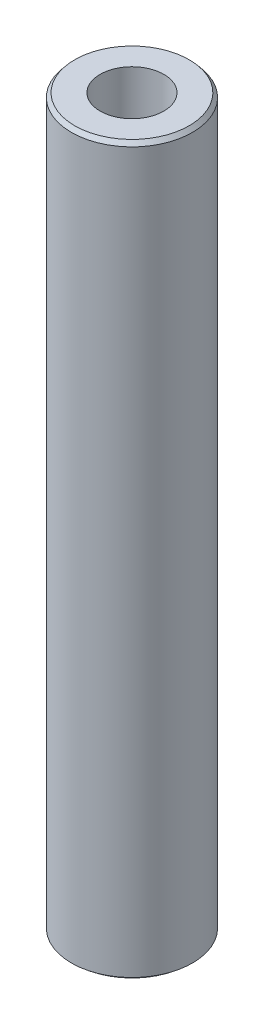
ISO-10303-21;
HEADER;
FILE_DESCRIPTION(('STEP AP214'),'2;1');
FILE_NAME('part.step','',(''),(''),'','','');
FILE_SCHEMA(('AUTOMOTIVE_DESIGN { 1 0 10303 214 1 1 1 1 }'));
ENDSEC;
DATA;
#1=APPLICATION_CONTEXT('core data for automotive mechanical design processes');
#2=APPLICATION_PROTOCOL_DEFINITION('international standard','automotive_design',2000,#1);
#3=PRODUCT_CONTEXT('',#1,'mechanical');
#4=PRODUCT('Part','Part','',(#3));
#5=PRODUCT_RELATED_PRODUCT_CATEGORY('part','',(#4));
#6=PRODUCT_DEFINITION_FORMATION('','',#4);
#7=PRODUCT_DEFINITION_CONTEXT('part definition',#1,'design');
#8=PRODUCT_DEFINITION('design','',#6,#7);
#9=PRODUCT_DEFINITION_SHAPE('','',#8);
#10=(LENGTH_UNIT() NAMED_UNIT(*) SI_UNIT(.MILLI.,.METRE.));
#11=(NAMED_UNIT(*) PLANE_ANGLE_UNIT() SI_UNIT($,.RADIAN.));
#12=(NAMED_UNIT(*) SI_UNIT($,.STERADIAN.) SOLID_ANGLE_UNIT());
#13=UNCERTAINTY_MEASURE_WITH_UNIT(LENGTH_MEASURE(1.E-05),#10,'distance_accuracy_value','');
#14=(GEOMETRIC_REPRESENTATION_CONTEXT(3) GLOBAL_UNCERTAINTY_ASSIGNED_CONTEXT((#13)) GLOBAL_UNIT_ASSIGNED_CONTEXT((#10,
#11,#12)) REPRESENTATION_CONTEXT('',''));
#15=CARTESIAN_POINT('',(0.,0.,0.));
#16=DIRECTION('',(0.,0.,1.));
#17=DIRECTION('',(1.,0.,0.));
#18=AXIS2_PLACEMENT_3D('',#15,#16,#17);
#19=CARTESIAN_POINT('',(0.,600.,0.));
#20=DIRECTION('',(0.,-1.,0.));
#21=DIRECTION('',(0.,0.,-1.));
#22=AXIS2_PLACEMENT_3D('',#19,#20,#21);
#23=CYLINDRICAL_SURFACE('',#22,50.);
#24=CARTESIAN_POINT('',(0.,596.621895699782,0.));
#25=DIRECTION('',(0.,1.,0.));
#26=DIRECTION('',(0.,0.,1.));
#27=AXIS2_PLACEMENT_3D('',#24,#25,#26);
#28=CIRCLE('',#27,50.);
#29=CARTESIAN_POINT('',(0.,596.621895699782,50.));
#30=VERTEX_POINT('',#29);
#31=EDGE_CURVE('E50',#30,#30,#28,.F.);
#32=ORIENTED_EDGE('',*,*,#31,.T.);
#33=EDGE_LOOP('',(#32));
#34=FACE_BOUND('',#33,.T.);
#35=CARTESIAN_POINT('',(0.,2.75421378136709,0.));
#36=DIRECTION('',(0.,1.,0.));
#37=DIRECTION('',(0.,0.,1.));
#38=AXIS2_PLACEMENT_3D('',#35,#36,#37);
#39=CIRCLE('',#38,50.);
#40=CARTESIAN_POINT('',(0.,2.75421378136709,50.));
#41=VERTEX_POINT('',#40);
#42=EDGE_CURVE('E51',#41,#41,#39,.T.);
#43=ORIENTED_EDGE('',*,*,#42,.T.);
#44=EDGE_LOOP('',(#43));
#45=FACE_BOUND('',#44,.T.);
#46=ADVANCED_FACE('F39',(#34,#45),#23,.T.);
#47=CARTESIAN_POINT('',(0.,600.,0.));
#48=DIRECTION('',(0.,1.,0.));
#49=DIRECTION('',(0.,0.,1.));
#50=AXIS2_PLACEMENT_3D('',#47,#48,#49);
#51=PLANE('',#50);
#52=CARTESIAN_POINT('',(0.,600.,0.));
#53=DIRECTION('',(0.,1.,0.));
#54=DIRECTION('',(0.,0.,1.));
#55=AXIS2_PLACEMENT_3D('',#52,#53,#54);
#56=CIRCLE('',#55,47.2457862186328);
#57=CARTESIAN_POINT('',(0.,600.,47.2457862186328));
#58=VERTEX_POINT('',#57);
#59=EDGE_CURVE('E54',#58,#58,#56,.T.);
#60=ORIENTED_EDGE('',*,*,#59,.T.);
#61=EDGE_LOOP('',(#60));
#62=FACE_BOUND('',#61,.T.);
#63=CARTESIAN_POINT('',(0.,600.,0.));
#64=DIRECTION('',(0.,1.,0.));
#65=DIRECTION('',(0.,0.,1.));
#66=AXIS2_PLACEMENT_3D('',#63,#64,#65);
#67=CIRCLE('',#66,26.3071268832011);
#68=CARTESIAN_POINT('',(0.,600.,26.3071268832011));
#69=VERTEX_POINT('',#68);
#70=EDGE_CURVE('E58',#69,#69,#67,.T.);
#71=ORIENTED_EDGE('',*,*,#70,.F.);
#72=EDGE_LOOP('',(#71));
#73=FACE_BOUND('',#72,.T.);
#74=ADVANCED_FACE('F69',(#62,#73),#51,.T.);
#75=CARTESIAN_POINT('',(0.,0.,0.));
#76=DIRECTION('',(0.,1.,0.));
#77=DIRECTION('',(0.,0.,1.));
#78=AXIS2_PLACEMENT_3D('',#75,#76,#77);
#79=PLANE('',#78);
#80=CARTESIAN_POINT('',(0.,0.,0.));
#81=DIRECTION('',(0.,1.,0.));
#82=DIRECTION('',(0.,0.,1.));
#83=AXIS2_PLACEMENT_3D('',#80,#81,#82);
#84=CIRCLE('',#83,46.6218956997819);
#85=CARTESIAN_POINT('',(0.,0.,46.6218956997819));
#86=VERTEX_POINT('',#85);
#87=EDGE_CURVE('E10',#86,#86,#84,.F.);
#88=ORIENTED_EDGE('',*,*,#87,.T.);
#89=EDGE_LOOP('',(#88));
#90=FACE_BOUND('',#89,.T.);
#91=CARTESIAN_POINT('',(0.,0.,0.));
#92=DIRECTION('',(0.,1.,0.));
#93=DIRECTION('',(0.,0.,1.));
#94=AXIS2_PLACEMENT_3D('',#91,#92,#93);
#95=CIRCLE('',#94,26.3071268832011);
#96=CARTESIAN_POINT('',(0.,0.,26.3071268832011));
#97=VERTEX_POINT('',#96);
#98=EDGE_CURVE('E63',#97,#97,#95,.T.);
#99=ORIENTED_EDGE('',*,*,#98,.T.);
#100=EDGE_LOOP('',(#99));
#101=FACE_BOUND('',#100,.T.);
#102=ADVANCED_FACE('F75',(#90,#101),#79,.F.);
#103=CARTESIAN_POINT('',(0.,600.,0.));
#104=DIRECTION('',(0.,-1.,0.));
#105=DIRECTION('',(0.,0.,-1.));
#106=AXIS2_PLACEMENT_3D('',#103,#104,#105);
#107=CYLINDRICAL_SURFACE('',#106,26.3071268832011);
#108=ORIENTED_EDGE('',*,*,#70,.T.);
#109=EDGE_LOOP('',(#108));
#110=FACE_BOUND('',#109,.T.);
#111=ORIENTED_EDGE('',*,*,#98,.F.);
#112=EDGE_LOOP('',(#111));
#113=FACE_BOUND('',#112,.T.);
#114=ADVANCED_FACE('F70',(#110,#113),#107,.F.);
#115=CARTESIAN_POINT('',(0.,600.,0.));
#116=DIRECTION('',(0.,-1.,0.));
#117=DIRECTION('',(0.,0.,-1.));
#118=AXIS2_PLACEMENT_3D('',#115,#116,#117);
#119=CONICAL_SURFACE('',#118,47.2457862186328,0.684008896849091);
#120=ORIENTED_EDGE('',*,*,#31,.F.);
#121=EDGE_LOOP('',(#120));
#122=FACE_BOUND('',#121,.T.);
#123=ORIENTED_EDGE('',*,*,#59,.F.);
#124=EDGE_LOOP('',(#123));
#125=FACE_BOUND('',#124,.T.);
#126=ADVANCED_FACE('F81',(#122,#125),#119,.T.);
#127=CARTESIAN_POINT('',(0.,2.75421378136709,0.));
#128=DIRECTION('',(0.,1.,0.));
#129=DIRECTION('',(0.,0.,1.));
#130=AXIS2_PLACEMENT_3D('',#127,#128,#129);
#131=CONICAL_SURFACE('',#130,50.,0.886787429945806);
#132=ORIENTED_EDGE('',*,*,#87,.F.);
#133=EDGE_LOOP('',(#132));
#134=FACE_BOUND('',#133,.T.);
#135=ORIENTED_EDGE('',*,*,#42,.F.);
#136=EDGE_LOOP('',(#135));
#137=FACE_BOUND('',#136,.T.);
#138=ADVANCED_FACE('F45',(#134,#137),#131,.T.);
#139=CLOSED_SHELL('',(#46,#74,#102,#114,#126,#138));
#140=MANIFOLD_SOLID_BREP('B2',#139);
#141=ADVANCED_BREP_SHAPE_REPRESENTATION('',(#18,#140),#14);
#142=SHAPE_DEFINITION_REPRESENTATION(#9,#141);
ENDSEC;
END-ISO-10303-21;
